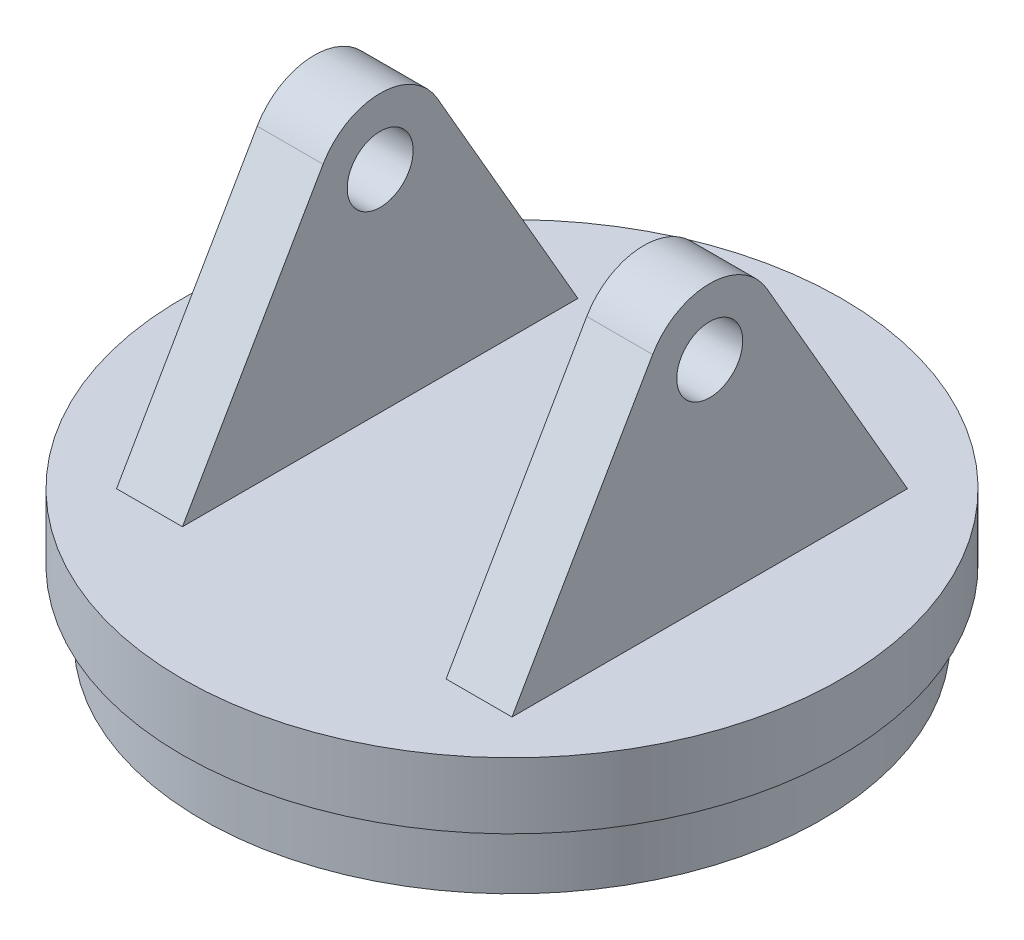
ISO-10303-21;
HEADER;
FILE_DESCRIPTION(('STEP AP214'),'2;1');
FILE_NAME('part.step','',(''),(''),'','','');
FILE_SCHEMA(('AUTOMOTIVE_DESIGN { 1 0 10303 214 1 1 1 1 }'));
ENDSEC;
DATA;
#1=APPLICATION_CONTEXT('core data for automotive mechanical design processes');
#2=APPLICATION_PROTOCOL_DEFINITION('international standard','automotive_design',2000,#1);
#3=PRODUCT_CONTEXT('',#1,'mechanical');
#4=PRODUCT('Part','Part','',(#3));
#5=PRODUCT_RELATED_PRODUCT_CATEGORY('part','',(#4));
#6=PRODUCT_DEFINITION_FORMATION('','',#4);
#7=PRODUCT_DEFINITION_CONTEXT('part definition',#1,'design');
#8=PRODUCT_DEFINITION('design','',#6,#7);
#9=PRODUCT_DEFINITION_SHAPE('','',#8);
#10=(LENGTH_UNIT() NAMED_UNIT(*) SI_UNIT(.MILLI.,.METRE.));
#11=(NAMED_UNIT(*) PLANE_ANGLE_UNIT() SI_UNIT($,.RADIAN.));
#12=(NAMED_UNIT(*) SI_UNIT($,.STERADIAN.) SOLID_ANGLE_UNIT());
#13=UNCERTAINTY_MEASURE_WITH_UNIT(LENGTH_MEASURE(1.E-05),#10,'distance_accuracy_value','');
#14=(GEOMETRIC_REPRESENTATION_CONTEXT(3) GLOBAL_UNCERTAINTY_ASSIGNED_CONTEXT((#13)) GLOBAL_UNIT_ASSIGNED_CONTEXT((#10,
#11,#12)) REPRESENTATION_CONTEXT('',''));
#15=CARTESIAN_POINT('',(0.,0.,0.));
#16=DIRECTION('',(0.,0.,1.));
#17=DIRECTION('',(1.,0.,0.));
#18=AXIS2_PLACEMENT_3D('',#15,#16,#17);
#19=CARTESIAN_POINT('',(0.,10.,0.));
#20=DIRECTION('',(0.,1.,0.));
#21=DIRECTION('',(0.,0.,1.));
#22=AXIS2_PLACEMENT_3D('',#19,#20,#21);
#23=PLANE('',#22);
#24=DIRECTION('',(0.,0.,-1.));
#25=VECTOR('',#24,1.);
#26=CARTESIAN_POINT('',(-30.,10.,-30.));
#27=LINE('',#26,#25);
#28=CARTESIAN_POINT('',(-30.,10.,30.));
#29=VERTEX_POINT('',#28);
#30=CARTESIAN_POINT('',(-30.,10.,-30.));
#31=VERTEX_POINT('',#30);
#32=EDGE_CURVE('E118',#29,#31,#27,.T.);
#33=ORIENTED_EDGE('',*,*,#32,.T.);
#34=DIRECTION('',(1.,0.,0.));
#35=VECTOR('',#34,1.);
#36=CARTESIAN_POINT('',(-30.,10.,-30.));
#37=LINE('',#36,#35);
#38=CARTESIAN_POINT('',(-20.,10.,-30.));
#39=VERTEX_POINT('',#38);
#40=EDGE_CURVE('E102',#31,#39,#37,.T.);
#41=ORIENTED_EDGE('',*,*,#40,.T.);
#42=DIRECTION('',(0.,0.,-1.));
#43=VECTOR('',#42,1.);
#44=CARTESIAN_POINT('',(-20.,10.,-30.));
#45=LINE('',#44,#43);
#46=CARTESIAN_POINT('',(-20.,10.,30.));
#47=VERTEX_POINT('',#46);
#48=EDGE_CURVE('E135',#47,#39,#45,.T.);
#49=ORIENTED_EDGE('',*,*,#48,.F.);
#50=DIRECTION('',(1.,0.,0.));
#51=VECTOR('',#50,1.);
#52=CARTESIAN_POINT('',(-30.,10.,30.));
#53=LINE('',#52,#51);
#54=EDGE_CURVE('E125',#29,#47,#53,.T.);
#55=ORIENTED_EDGE('',*,*,#54,.F.);
#56=EDGE_LOOP('',(#33,#41,#49,#55));
#57=FACE_BOUND('',#56,.T.);
#58=CARTESIAN_POINT('',(0.,10.,0.));
#59=DIRECTION('',(0.,1.,0.));
#60=DIRECTION('',(0.,0.,1.));
#61=AXIS2_PLACEMENT_3D('',#58,#59,#60);
#62=CIRCLE('',#61,50.);
#63=CARTESIAN_POINT('',(0.,10.,50.));
#64=VERTEX_POINT('',#63);
#65=EDGE_CURVE('E41',#64,#64,#62,.T.);
#66=ORIENTED_EDGE('',*,*,#65,.T.);
#67=EDGE_LOOP('',(#66));
#68=FACE_BOUND('',#67,.T.);
#69=DIRECTION('',(0.,0.,-1.));
#70=VECTOR('',#69,1.);
#71=CARTESIAN_POINT('',(20.,10.,-30.));
#72=LINE('',#71,#70);
#73=CARTESIAN_POINT('',(20.,10.,30.));
#74=VERTEX_POINT('',#73);
#75=CARTESIAN_POINT('',(20.,10.,-30.));
#76=VERTEX_POINT('',#75);
#77=EDGE_CURVE('E57',#74,#76,#72,.T.);
#78=ORIENTED_EDGE('',*,*,#77,.T.);
#79=DIRECTION('',(-1.,0.,0.));
#80=VECTOR('',#79,1.);
#81=CARTESIAN_POINT('',(30.,10.,-30.));
#82=LINE('',#81,#80);
#83=CARTESIAN_POINT('',(30.,10.,-30.));
#84=VERTEX_POINT('',#83);
#85=EDGE_CURVE('E175',#84,#76,#82,.T.);
#86=ORIENTED_EDGE('',*,*,#85,.F.);
#87=DIRECTION('',(0.,0.,-1.));
#88=VECTOR('',#87,1.);
#89=CARTESIAN_POINT('',(30.,10.,-30.));
#90=LINE('',#89,#88);
#91=CARTESIAN_POINT('',(30.,10.,30.));
#92=VERTEX_POINT('',#91);
#93=EDGE_CURVE('E150',#92,#84,#90,.T.);
#94=ORIENTED_EDGE('',*,*,#93,.F.);
#95=DIRECTION('',(-1.,0.,0.));
#96=VECTOR('',#95,1.);
#97=CARTESIAN_POINT('',(30.,10.,30.));
#98=LINE('',#97,#96);
#99=EDGE_CURVE('E160',#92,#74,#98,.T.);
#100=ORIENTED_EDGE('',*,*,#99,.T.);
#101=EDGE_LOOP('',(#78,#86,#94,#100));
#102=FACE_BOUND('',#101,.T.);
#103=ADVANCED_FACE('F32',(#57,#68,#102),#23,.T.);
#104=CARTESIAN_POINT('',(0.,10.,0.));
#105=DIRECTION('',(0.,-1.,0.));
#106=DIRECTION('',(0.,0.,-1.));
#107=AXIS2_PLACEMENT_3D('',#104,#105,#106);
#108=CYLINDRICAL_SURFACE('',#107,50.);
#109=ORIENTED_EDGE('',*,*,#65,.F.);
#110=EDGE_LOOP('',(#109));
#111=FACE_BOUND('',#110,.T.);
#112=CARTESIAN_POINT('',(0.,0.,0.));
#113=DIRECTION('',(0.,1.,0.));
#114=DIRECTION('',(0.,0.,1.));
#115=AXIS2_PLACEMENT_3D('',#112,#113,#114);
#116=CIRCLE('',#115,50.);
#117=CARTESIAN_POINT('',(0.,0.,50.));
#118=VERTEX_POINT('',#117);
#119=EDGE_CURVE('E36',#118,#118,#116,.T.);
#120=ORIENTED_EDGE('',*,*,#119,.T.);
#121=EDGE_LOOP('',(#120));
#122=FACE_BOUND('',#121,.T.);
#123=ADVANCED_FACE('F34',(#111,#122),#108,.T.);
#124=CARTESIAN_POINT('',(0.,0.,0.));
#125=DIRECTION('',(0.,1.,0.));
#126=DIRECTION('',(0.,0.,1.));
#127=AXIS2_PLACEMENT_3D('',#124,#125,#126);
#128=PLANE('',#127);
#129=CARTESIAN_POINT('',(0.,0.,0.));
#130=DIRECTION('',(0.,-1.,0.));
#131=DIRECTION('',(0.,0.,-1.));
#132=AXIS2_PLACEMENT_3D('',#129,#130,#131);
#133=CIRCLE('',#132,47.);
#134=CARTESIAN_POINT('',(0.,0.,-47.));
#135=VERTEX_POINT('',#134);
#136=EDGE_CURVE('E11',#135,#135,#133,.T.);
#137=ORIENTED_EDGE('',*,*,#136,.F.);
#138=EDGE_LOOP('',(#137));
#139=FACE_BOUND('',#138,.T.);
#140=ORIENTED_EDGE('',*,*,#119,.F.);
#141=EDGE_LOOP('',(#140));
#142=FACE_BOUND('',#141,.T.);
#143=ADVANCED_FACE('F183',(#139,#142),#128,.F.);
#144=CARTESIAN_POINT('',(30.,41.9615242270663,0.));
#145=DIRECTION('',(-1.,0.,0.));
#146=DIRECTION('',(0.,0.,1.));
#147=AXIS2_PLACEMENT_3D('',#144,#145,#146);
#148=PLANE('',#147);
#149=ORIENTED_EDGE('',*,*,#93,.T.);
#150=DIRECTION('',(0.,0.866025403784438,0.5));
#151=VECTOR('',#150,1.);
#152=CARTESIAN_POINT('',(30.,10.,-30.));
#153=LINE('',#152,#151);
#154=CARTESIAN_POINT('',(30.,46.9615242270662,-8.66025403784446));
#155=VERTEX_POINT('',#154);
#156=EDGE_CURVE('E153',#84,#155,#153,.T.);
#157=ORIENTED_EDGE('',*,*,#156,.T.);
#158=CARTESIAN_POINT('',(30.,41.9615242270663,0.));
#159=DIRECTION('',(1.,0.,0.));
#160=DIRECTION('',(0.,0.,1.));
#161=AXIS2_PLACEMENT_3D('',#158,#159,#160);
#162=CIRCLE('',#161,10.);
#163=CARTESIAN_POINT('',(30.,46.9615242270662,8.66025403784445));
#164=VERTEX_POINT('',#163);
#165=EDGE_CURVE('E156',#155,#164,#162,.T.);
#166=ORIENTED_EDGE('',*,*,#165,.T.);
#167=DIRECTION('',(0.,-0.866025403784439,0.5));
#168=VECTOR('',#167,1.);
#169=CARTESIAN_POINT('',(30.,46.9615242270662,8.66025403784445));
#170=LINE('',#169,#168);
#171=EDGE_CURVE('E158',#164,#92,#170,.T.);
#172=ORIENTED_EDGE('',*,*,#171,.T.);
#173=EDGE_LOOP('',(#149,#157,#166,#172));
#174=FACE_BOUND('',#173,.T.);
#175=CARTESIAN_POINT('',(30.,41.9615242270663,0.));
#176=DIRECTION('',(1.,0.,0.));
#177=DIRECTION('',(0.,0.,-1.));
#178=AXIS2_PLACEMENT_3D('',#175,#176,#177);
#179=CIRCLE('',#178,5.);
#180=CARTESIAN_POINT('',(30.,41.9615242270663,-5.));
#181=VERTEX_POINT('',#180);
#182=EDGE_CURVE('E145',#181,#181,#179,.T.);
#183=ORIENTED_EDGE('',*,*,#182,.F.);
#184=EDGE_LOOP('',(#183));
#185=FACE_BOUND('',#184,.T.);
#186=ADVANCED_FACE('F185',(#174,#185),#148,.F.);
#187=CARTESIAN_POINT('',(20.,41.9615242270663,0.));
#188=DIRECTION('',(-1.,0.,0.));
#189=DIRECTION('',(0.,0.,1.));
#190=AXIS2_PLACEMENT_3D('',#187,#188,#189);
#191=PLANE('',#190);
#192=ORIENTED_EDGE('',*,*,#77,.F.);
#193=DIRECTION('',(0.,-0.866025403784439,0.5));
#194=VECTOR('',#193,1.);
#195=CARTESIAN_POINT('',(20.,46.9615242270662,8.66025403784445));
#196=LINE('',#195,#194);
#197=CARTESIAN_POINT('',(20.,46.9615242270662,8.66025403784445));
#198=VERTEX_POINT('',#197);
#199=EDGE_CURVE('E154',#198,#74,#196,.T.);
#200=ORIENTED_EDGE('',*,*,#199,.F.);
#201=CARTESIAN_POINT('',(20.,41.9615242270663,0.));
#202=DIRECTION('',(1.,0.,0.));
#203=DIRECTION('',(0.,0.,1.));
#204=AXIS2_PLACEMENT_3D('',#201,#202,#203);
#205=CIRCLE('',#204,10.);
#206=CARTESIAN_POINT('',(20.,46.9615242270662,-8.66025403784446));
#207=VERTEX_POINT('',#206);
#208=EDGE_CURVE('E164',#207,#198,#205,.T.);
#209=ORIENTED_EDGE('',*,*,#208,.F.);
#210=DIRECTION('',(0.,0.866025403784438,0.5));
#211=VECTOR('',#210,1.);
#212=CARTESIAN_POINT('',(20.,10.,-30.));
#213=LINE('',#212,#211);
#214=EDGE_CURVE('E162',#76,#207,#213,.T.);
#215=ORIENTED_EDGE('',*,*,#214,.F.);
#216=EDGE_LOOP('',(#192,#200,#209,#215));
#217=FACE_BOUND('',#216,.T.);
#218=CARTESIAN_POINT('',(20.,41.9615242270663,0.));
#219=DIRECTION('',(1.,0.,0.));
#220=DIRECTION('',(0.,0.,-1.));
#221=AXIS2_PLACEMENT_3D('',#218,#219,#220);
#222=CIRCLE('',#221,5.);
#223=CARTESIAN_POINT('',(20.,41.9615242270663,-5.));
#224=VERTEX_POINT('',#223);
#225=EDGE_CURVE('E141',#224,#224,#222,.T.);
#226=ORIENTED_EDGE('',*,*,#225,.T.);
#227=EDGE_LOOP('',(#226));
#228=FACE_BOUND('',#227,.T.);
#229=ADVANCED_FACE('F191',(#217,#228),#191,.T.);
#230=CARTESIAN_POINT('',(30.,10.,-30.));
#231=DIRECTION('',(0.,-0.5,0.866025403784439));
#232=DIRECTION('',(0.,-0.866025403784439,-0.5));
#233=AXIS2_PLACEMENT_3D('',#230,#231,#232);
#234=PLANE('',#233);
#235=ORIENTED_EDGE('',*,*,#214,.T.);
#236=DIRECTION('',(-1.,0.,0.));
#237=VECTOR('',#236,1.);
#238=CARTESIAN_POINT('',(30.,46.9615242270662,-8.66025403784446));
#239=LINE('',#238,#237);
#240=EDGE_CURVE('E172',#155,#207,#239,.T.);
#241=ORIENTED_EDGE('',*,*,#240,.F.);
#242=ORIENTED_EDGE('',*,*,#156,.F.);
#243=ORIENTED_EDGE('',*,*,#85,.T.);
#244=EDGE_LOOP('',(#235,#241,#242,#243));
#245=FACE_BOUND('',#244,.T.);
#246=ADVANCED_FACE('F201',(#245),#234,.F.);
#247=CARTESIAN_POINT('',(30.,41.9615242270663,0.));
#248=DIRECTION('',(-1.,0.,0.));
#249=DIRECTION('',(0.,0.,1.));
#250=AXIS2_PLACEMENT_3D('',#247,#248,#249);
#251=CYLINDRICAL_SURFACE('',#250,10.);
#252=ORIENTED_EDGE('',*,*,#208,.T.);
#253=DIRECTION('',(-1.,0.,0.));
#254=VECTOR('',#253,1.);
#255=CARTESIAN_POINT('',(30.,46.9615242270662,8.66025403784445));
#256=LINE('',#255,#254);
#257=EDGE_CURVE('E169',#164,#198,#256,.T.);
#258=ORIENTED_EDGE('',*,*,#257,.F.);
#259=ORIENTED_EDGE('',*,*,#165,.F.);
#260=ORIENTED_EDGE('',*,*,#240,.T.);
#261=EDGE_LOOP('',(#252,#258,#259,#260));
#262=FACE_BOUND('',#261,.T.);
#263=ADVANCED_FACE('F204',(#262),#251,.T.);
#264=CARTESIAN_POINT('',(30.,46.9615242270662,8.66025403784445));
#265=DIRECTION('',(0.,-0.5,-0.866025403784439));
#266=DIRECTION('',(0.,0.866025403784439,-0.5));
#267=AXIS2_PLACEMENT_3D('',#264,#265,#266);
#268=PLANE('',#267);
#269=ORIENTED_EDGE('',*,*,#199,.T.);
#270=ORIENTED_EDGE('',*,*,#99,.F.);
#271=ORIENTED_EDGE('',*,*,#171,.F.);
#272=ORIENTED_EDGE('',*,*,#257,.T.);
#273=EDGE_LOOP('',(#269,#270,#271,#272));
#274=FACE_BOUND('',#273,.T.);
#275=ADVANCED_FACE('F208',(#274),#268,.F.);
#276=CARTESIAN_POINT('',(30.,41.9615242270663,0.));
#277=DIRECTION('',(-1.,0.,0.));
#278=DIRECTION('',(0.,0.,1.));
#279=AXIS2_PLACEMENT_3D('',#276,#277,#278);
#280=CYLINDRICAL_SURFACE('',#279,5.);
#281=ORIENTED_EDGE('',*,*,#182,.T.);
#282=EDGE_LOOP('',(#281));
#283=FACE_BOUND('',#282,.T.);
#284=ORIENTED_EDGE('',*,*,#225,.F.);
#285=EDGE_LOOP('',(#284));
#286=FACE_BOUND('',#285,.T.);
#287=ADVANCED_FACE('F212',(#283,#286),#280,.F.);
#288=CARTESIAN_POINT('',(-30.,46.9615242270662,8.66025403784445));
#289=DIRECTION('',(0.,0.5,0.866025403784439));
#290=DIRECTION('',(0.,-0.866025403784439,0.5));
#291=AXIS2_PLACEMENT_3D('',#288,#289,#290);
#292=PLANE('',#291);
#293=DIRECTION('',(0.,-0.866025403784439,0.5));
#294=VECTOR('',#293,1.);
#295=CARTESIAN_POINT('',(-20.,46.9615242270662,8.66025403784445));
#296=LINE('',#295,#294);
#297=CARTESIAN_POINT('',(-20.,46.9615242270662,8.66025403784445));
#298=VERTEX_POINT('',#297);
#299=EDGE_CURVE('E49',#298,#47,#296,.T.);
#300=ORIENTED_EDGE('',*,*,#299,.F.);
#301=DIRECTION('',(1.,0.,0.));
#302=VECTOR('',#301,1.);
#303=CARTESIAN_POINT('',(-30.,46.9615242270662,8.66025403784445));
#304=LINE('',#303,#302);
#305=CARTESIAN_POINT('',(-30.,46.9615242270662,8.66025403784445));
#306=VERTEX_POINT('',#305);
#307=EDGE_CURVE('E142',#306,#298,#304,.T.);
#308=ORIENTED_EDGE('',*,*,#307,.F.);
#309=DIRECTION('',(0.,-0.866025403784439,0.5));
#310=VECTOR('',#309,1.);
#311=CARTESIAN_POINT('',(-30.,46.9615242270662,8.66025403784445));
#312=LINE('',#311,#310);
#313=EDGE_CURVE('E112',#306,#29,#312,.T.);
#314=ORIENTED_EDGE('',*,*,#313,.T.);
#315=ORIENTED_EDGE('',*,*,#54,.T.);
#316=EDGE_LOOP('',(#300,#308,#314,#315));
#317=FACE_BOUND('',#316,.T.);
#318=ADVANCED_FACE('F218',(#317),#292,.T.);
#319=CARTESIAN_POINT('',(-30.,41.9615242270663,0.));
#320=DIRECTION('',(1.,0.,0.));
#321=DIRECTION('',(0.,0.,-1.));
#322=AXIS2_PLACEMENT_3D('',#319,#320,#321);
#323=CYLINDRICAL_SURFACE('',#322,10.);
#324=CARTESIAN_POINT('',(-20.,41.9615242270663,0.));
#325=DIRECTION('',(1.,0.,0.));
#326=DIRECTION('',(0.,0.,1.));
#327=AXIS2_PLACEMENT_3D('',#324,#325,#326);
#328=CIRCLE('',#327,10.);
#329=CARTESIAN_POINT('',(-20.,46.9615242270662,-8.66025403784446));
#330=VERTEX_POINT('',#329);
#331=EDGE_CURVE('E127',#330,#298,#328,.T.);
#332=ORIENTED_EDGE('',*,*,#331,.F.);
#333=DIRECTION('',(1.,0.,0.));
#334=VECTOR('',#333,1.);
#335=CARTESIAN_POINT('',(-30.,46.9615242270662,-8.66025403784446));
#336=LINE('',#335,#334);
#337=CARTESIAN_POINT('',(-30.,46.9615242270662,-8.66025403784446));
#338=VERTEX_POINT('',#337);
#339=EDGE_CURVE('E111',#338,#330,#336,.T.);
#340=ORIENTED_EDGE('',*,*,#339,.F.);
#341=CARTESIAN_POINT('',(-30.,41.9615242270663,0.));
#342=DIRECTION('',(1.,0.,0.));
#343=DIRECTION('',(0.,0.,1.));
#344=AXIS2_PLACEMENT_3D('',#341,#342,#343);
#345=CIRCLE('',#344,10.);
#346=EDGE_CURVE('E121',#338,#306,#345,.T.);
#347=ORIENTED_EDGE('',*,*,#346,.T.);
#348=ORIENTED_EDGE('',*,*,#307,.T.);
#349=EDGE_LOOP('',(#332,#340,#347,#348));
#350=FACE_BOUND('',#349,.T.);
#351=ADVANCED_FACE('F222',(#350),#323,.T.);
#352=CARTESIAN_POINT('',(-30.,10.,-30.));
#353=DIRECTION('',(0.,0.5,-0.866025403784439));
#354=DIRECTION('',(0.,0.866025403784439,0.5));
#355=AXIS2_PLACEMENT_3D('',#352,#353,#354);
#356=PLANE('',#355);
#357=DIRECTION('',(0.,0.866025403784438,0.5));
#358=VECTOR('',#357,1.);
#359=CARTESIAN_POINT('',(-20.,10.,-30.));
#360=LINE('',#359,#358);
#361=EDGE_CURVE('E107',#39,#330,#360,.T.);
#362=ORIENTED_EDGE('',*,*,#361,.F.);
#363=ORIENTED_EDGE('',*,*,#40,.F.);
#364=DIRECTION('',(0.,0.866025403784438,0.5));
#365=VECTOR('',#364,1.);
#366=CARTESIAN_POINT('',(-30.,10.,-30.));
#367=LINE('',#366,#365);
#368=EDGE_CURVE('E105',#31,#338,#367,.T.);
#369=ORIENTED_EDGE('',*,*,#368,.T.);
#370=ORIENTED_EDGE('',*,*,#339,.T.);
#371=EDGE_LOOP('',(#362,#363,#369,#370));
#372=FACE_BOUND('',#371,.T.);
#373=ADVANCED_FACE('F104',(#372),#356,.T.);
#374=CARTESIAN_POINT('',(-30.,41.9615242270663,0.));
#375=DIRECTION('',(-1.,0.,0.));
#376=DIRECTION('',(0.,0.,1.));
#377=AXIS2_PLACEMENT_3D('',#374,#375,#376);
#378=PLANE('',#377);
#379=CARTESIAN_POINT('',(-30.,41.9615242270663,0.));
#380=DIRECTION('',(1.,0.,0.));
#381=DIRECTION('',(0.,0.,-1.));
#382=AXIS2_PLACEMENT_3D('',#379,#380,#381);
#383=CIRCLE('',#382,5.);
#384=CARTESIAN_POINT('',(-30.,41.9615242270663,-5.));
#385=VERTEX_POINT('',#384);
#386=EDGE_CURVE('E137',#385,#385,#383,.T.);
#387=ORIENTED_EDGE('',*,*,#386,.T.);
#388=EDGE_LOOP('',(#387));
#389=FACE_BOUND('',#388,.T.);
#390=ORIENTED_EDGE('',*,*,#32,.F.);
#391=ORIENTED_EDGE('',*,*,#313,.F.);
#392=ORIENTED_EDGE('',*,*,#346,.F.);
#393=ORIENTED_EDGE('',*,*,#368,.F.);
#394=EDGE_LOOP('',(#390,#391,#392,#393));
#395=FACE_BOUND('',#394,.T.);
#396=ADVANCED_FACE('F116',(#389,#395),#378,.T.);
#397=CARTESIAN_POINT('',(-20.,41.9615242270663,0.));
#398=DIRECTION('',(-1.,0.,0.));
#399=DIRECTION('',(0.,0.,1.));
#400=AXIS2_PLACEMENT_3D('',#397,#398,#399);
#401=PLANE('',#400);
#402=CARTESIAN_POINT('',(-20.,41.9615242270663,0.));
#403=DIRECTION('',(1.,0.,0.));
#404=DIRECTION('',(0.,0.,-1.));
#405=AXIS2_PLACEMENT_3D('',#402,#403,#404);
#406=CIRCLE('',#405,5.);
#407=CARTESIAN_POINT('',(-20.,41.9615242270663,-5.));
#408=VERTEX_POINT('',#407);
#409=EDGE_CURVE('E130',#408,#408,#406,.T.);
#410=ORIENTED_EDGE('',*,*,#409,.F.);
#411=EDGE_LOOP('',(#410));
#412=FACE_BOUND('',#411,.T.);
#413=ORIENTED_EDGE('',*,*,#48,.T.);
#414=ORIENTED_EDGE('',*,*,#361,.T.);
#415=ORIENTED_EDGE('',*,*,#331,.T.);
#416=ORIENTED_EDGE('',*,*,#299,.T.);
#417=EDGE_LOOP('',(#413,#414,#415,#416));
#418=FACE_BOUND('',#417,.T.);
#419=ADVANCED_FACE('F229',(#412,#418),#401,.F.);
#420=CARTESIAN_POINT('',(-30.,41.9615242270663,0.));
#421=DIRECTION('',(1.,0.,0.));
#422=DIRECTION('',(0.,0.,-1.));
#423=AXIS2_PLACEMENT_3D('',#420,#421,#422);
#424=CYLINDRICAL_SURFACE('',#423,5.);
#425=ORIENTED_EDGE('',*,*,#386,.F.);
#426=EDGE_LOOP('',(#425));
#427=FACE_BOUND('',#426,.T.);
#428=ORIENTED_EDGE('',*,*,#409,.T.);
#429=EDGE_LOOP('',(#428));
#430=FACE_BOUND('',#429,.T.);
#431=ADVANCED_FACE('F232',(#427,#430),#424,.F.);
#432=CARTESIAN_POINT('',(0.,-10.,0.));
#433=DIRECTION('',(0.,1.,0.));
#434=DIRECTION('',(0.,0.,1.));
#435=AXIS2_PLACEMENT_3D('',#432,#433,#434);
#436=CYLINDRICAL_SURFACE('',#435,47.);
#437=CARTESIAN_POINT('',(0.,-10.,0.));
#438=DIRECTION('',(0.,-1.,0.));
#439=DIRECTION('',(0.,0.,-1.));
#440=AXIS2_PLACEMENT_3D('',#437,#438,#439);
#441=CIRCLE('',#440,47.);
#442=CARTESIAN_POINT('',(0.,-10.,-47.));
#443=VERTEX_POINT('',#442);
#444=EDGE_CURVE('E260',#443,#443,#441,.T.);
#445=ORIENTED_EDGE('',*,*,#444,.F.);
#446=EDGE_LOOP('',(#445));
#447=FACE_BOUND('',#446,.T.);
#448=ORIENTED_EDGE('',*,*,#136,.T.);
#449=EDGE_LOOP('',(#448));
#450=FACE_BOUND('',#449,.T.);
#451=ADVANCED_FACE('F239',(#447,#450),#436,.T.);
#452=CARTESIAN_POINT('',(0.,-10.,0.));
#453=DIRECTION('',(0.,-1.,0.));
#454=DIRECTION('',(0.,0.,-1.));
#455=AXIS2_PLACEMENT_3D('',#452,#453,#454);
#456=PLANE('',#455);
#457=CARTESIAN_POINT('',(0.,-10.,0.));
#458=DIRECTION('',(0.,-1.,0.));
#459=DIRECTION('',(0.,0.,-1.));
#460=AXIS2_PLACEMENT_3D('',#457,#458,#459);
#461=CIRCLE('',#460,2.5);
#462=CARTESIAN_POINT('',(0.,-10.,-2.5));
#463=VERTEX_POINT('',#462);
#464=EDGE_CURVE('E261',#463,#463,#461,.T.);
#465=ORIENTED_EDGE('',*,*,#464,.F.);
#466=EDGE_LOOP('',(#465));
#467=FACE_BOUND('',#466,.T.);
#468=ORIENTED_EDGE('',*,*,#444,.T.);
#469=EDGE_LOOP('',(#468));
#470=FACE_BOUND('',#469,.T.);
#471=ADVANCED_FACE('F243',(#467,#470),#456,.T.);
#472=CARTESIAN_POINT('',(0.,0.,0.));
#473=DIRECTION('',(0.,-1.,0.));
#474=DIRECTION('',(0.,0.,-1.));
#475=AXIS2_PLACEMENT_3D('',#472,#473,#474);
#476=CYLINDRICAL_SURFACE('',#475,2.5);
#477=CARTESIAN_POINT('',(0.,0.,0.));
#478=DIRECTION('',(0.,-1.,0.));
#479=DIRECTION('',(0.,0.,-1.));
#480=AXIS2_PLACEMENT_3D('',#477,#478,#479);
#481=CIRCLE('',#480,2.5);
#482=CARTESIAN_POINT('',(0.,0.,-2.5));
#483=VERTEX_POINT('',#482);
#484=EDGE_CURVE('E259',#483,#483,#481,.T.);
#485=ORIENTED_EDGE('',*,*,#484,.F.);
#486=EDGE_LOOP('',(#485));
#487=FACE_BOUND('',#486,.T.);
#488=ORIENTED_EDGE('',*,*,#464,.T.);
#489=EDGE_LOOP('',(#488));
#490=FACE_BOUND('',#489,.T.);
#491=ADVANCED_FACE('F247',(#487,#490),#476,.F.);
#492=CARTESIAN_POINT('',(0.,0.,0.));
#493=DIRECTION('',(0.,-1.,0.));
#494=DIRECTION('',(0.,0.,-1.));
#495=AXIS2_PLACEMENT_3D('',#492,#493,#494);
#496=PLANE('',#495);
#497=ORIENTED_EDGE('',*,*,#484,.T.);
#498=EDGE_LOOP('',(#497));
#499=FACE_BOUND('',#498,.T.);
#500=ADVANCED_FACE('F251',(#499),#496,.T.);
#501=CLOSED_SHELL('',(#103,#123,#143,#186,#229,#246,#263,#275,#287,#318,#351,#373,#396,#419,
#431,#451,#471,#491,#500));
#502=MANIFOLD_SOLID_BREP('B2',#501);
#503=ADVANCED_BREP_SHAPE_REPRESENTATION('',(#18,#502),#14);
#504=SHAPE_DEFINITION_REPRESENTATION(#9,#503);
ENDSEC;
END-ISO-10303-21;
